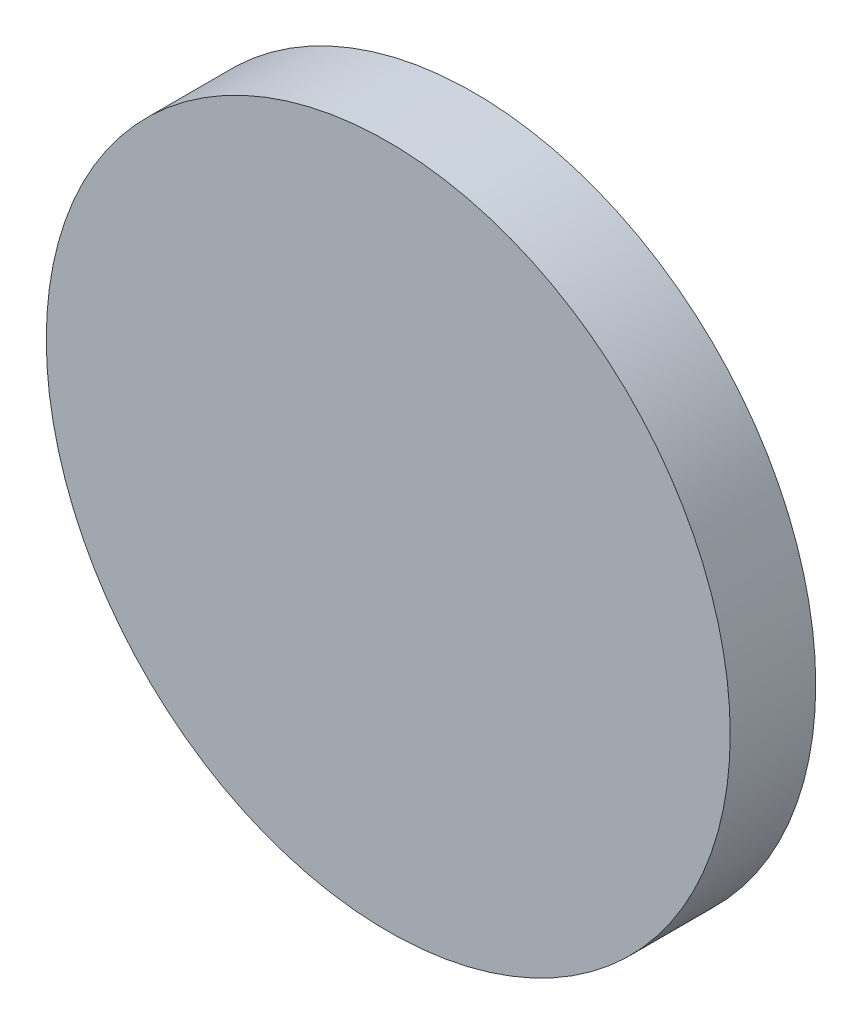
ISO-10303-21;
HEADER;
FILE_DESCRIPTION(('STEP AP214'),'2;1');
FILE_NAME('part.step','',(''),(''),'','','');
FILE_SCHEMA(('AUTOMOTIVE_DESIGN { 1 0 10303 214 1 1 1 1 }'));
ENDSEC;
DATA;
#1=APPLICATION_CONTEXT('core data for automotive mechanical design processes');
#2=APPLICATION_PROTOCOL_DEFINITION('international standard','automotive_design',2000,#1);
#3=PRODUCT_CONTEXT('',#1,'mechanical');
#4=PRODUCT('Part','Part','',(#3));
#5=PRODUCT_RELATED_PRODUCT_CATEGORY('part','',(#4));
#6=PRODUCT_DEFINITION_FORMATION('','',#4);
#7=PRODUCT_DEFINITION_CONTEXT('part definition',#1,'design');
#8=PRODUCT_DEFINITION('design','',#6,#7);
#9=PRODUCT_DEFINITION_SHAPE('','',#8);
#10=(LENGTH_UNIT() NAMED_UNIT(*) SI_UNIT(.MILLI.,.METRE.));
#11=(NAMED_UNIT(*) PLANE_ANGLE_UNIT() SI_UNIT($,.RADIAN.));
#12=(NAMED_UNIT(*) SI_UNIT($,.STERADIAN.) SOLID_ANGLE_UNIT());
#13=UNCERTAINTY_MEASURE_WITH_UNIT(LENGTH_MEASURE(1.E-05),#10,'distance_accuracy_value','');
#14=(GEOMETRIC_REPRESENTATION_CONTEXT(3) GLOBAL_UNCERTAINTY_ASSIGNED_CONTEXT((#13)) GLOBAL_UNIT_ASSIGNED_CONTEXT((#10,
#11,#12)) REPRESENTATION_CONTEXT('',''));
#15=CARTESIAN_POINT('',(0.,0.,0.));
#16=DIRECTION('',(0.,0.,1.));
#17=DIRECTION('',(1.,0.,0.));
#18=AXIS2_PLACEMENT_3D('',#15,#16,#17);
#19=CARTESIAN_POINT('',(0.,0.,1.));
#20=DIRECTION('',(0.,0.,-1.));
#21=DIRECTION('',(-1.,0.,0.));
#22=AXIS2_PLACEMENT_3D('',#19,#20,#21);
#23=CYLINDRICAL_SURFACE('',#22,4.);
#24=CARTESIAN_POINT('',(0.,0.,1.));
#25=DIRECTION('',(0.,0.,1.));
#26=DIRECTION('',(1.,0.,0.));
#27=AXIS2_PLACEMENT_3D('',#24,#25,#26);
#28=CIRCLE('',#27,4.);
#29=CARTESIAN_POINT('',(4.,0.,1.));
#30=VERTEX_POINT('',#29);
#31=EDGE_CURVE('E10',#30,#30,#28,.T.);
#32=ORIENTED_EDGE('',*,*,#31,.F.);
#33=EDGE_LOOP('',(#32));
#34=FACE_BOUND('',#33,.T.);
#35=CARTESIAN_POINT('',(0.,0.,0.));
#36=DIRECTION('',(0.,0.,1.));
#37=DIRECTION('',(1.,0.,0.));
#38=AXIS2_PLACEMENT_3D('',#35,#36,#37);
#39=CIRCLE('',#38,4.);
#40=CARTESIAN_POINT('',(4.,0.,0.));
#41=VERTEX_POINT('',#40);
#42=EDGE_CURVE('E33',#41,#41,#39,.T.);
#43=ORIENTED_EDGE('',*,*,#42,.T.);
#44=EDGE_LOOP('',(#43));
#45=FACE_BOUND('',#44,.T.);
#46=ADVANCED_FACE('F30',(#34,#45),#23,.T.);
#47=CARTESIAN_POINT('',(0.,0.,1.));
#48=DIRECTION('',(0.,0.,1.));
#49=DIRECTION('',(1.,0.,0.));
#50=AXIS2_PLACEMENT_3D('',#47,#48,#49);
#51=PLANE('',#50);
#52=ORIENTED_EDGE('',*,*,#31,.T.);
#53=EDGE_LOOP('',(#52));
#54=FACE_BOUND('',#53,.T.);
#55=ADVANCED_FACE('F45',(#54),#51,.T.);
#56=CARTESIAN_POINT('',(0.,0.,0.));
#57=DIRECTION('',(0.,0.,1.));
#58=DIRECTION('',(1.,0.,0.));
#59=AXIS2_PLACEMENT_3D('',#56,#57,#58);
#60=PLANE('',#59);
#61=ORIENTED_EDGE('',*,*,#42,.F.);
#62=EDGE_LOOP('',(#61));
#63=FACE_BOUND('',#62,.T.);
#64=ADVANCED_FACE('F43',(#63),#60,.F.);
#65=CLOSED_SHELL('',(#46,#55,#64));
#66=MANIFOLD_SOLID_BREP('B2',#65);
#67=ADVANCED_BREP_SHAPE_REPRESENTATION('',(#18,#66),#14);
#68=SHAPE_DEFINITION_REPRESENTATION(#9,#67);
ENDSEC;
END-ISO-10303-21;
